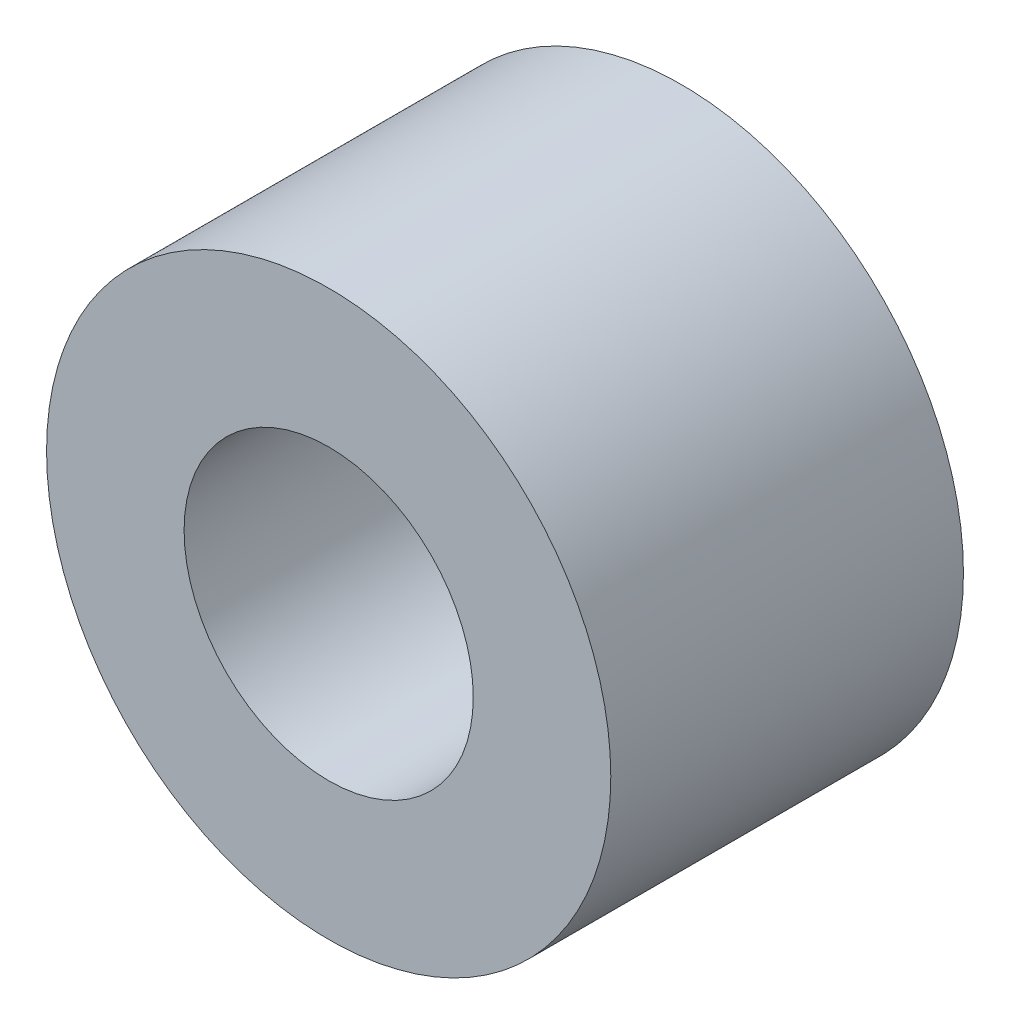
ISO-10303-21;
HEADER;
FILE_DESCRIPTION(('STEP AP214'),'2;1');
FILE_NAME('part.step','',(''),(''),'','','');
FILE_SCHEMA(('AUTOMOTIVE_DESIGN { 1 0 10303 214 1 1 1 1 }'));
ENDSEC;
DATA;
#1=APPLICATION_CONTEXT('core data for automotive mechanical design processes');
#2=APPLICATION_PROTOCOL_DEFINITION('international standard','automotive_design',2000,#1);
#3=PRODUCT_CONTEXT('',#1,'mechanical');
#4=PRODUCT('Part','Part','',(#3));
#5=PRODUCT_RELATED_PRODUCT_CATEGORY('part','',(#4));
#6=PRODUCT_DEFINITION_FORMATION('','',#4);
#7=PRODUCT_DEFINITION_CONTEXT('part definition',#1,'design');
#8=PRODUCT_DEFINITION('design','',#6,#7);
#9=PRODUCT_DEFINITION_SHAPE('','',#8);
#10=(LENGTH_UNIT() NAMED_UNIT(*) SI_UNIT(.MILLI.,.METRE.));
#11=(NAMED_UNIT(*) PLANE_ANGLE_UNIT() SI_UNIT($,.RADIAN.));
#12=(NAMED_UNIT(*) SI_UNIT($,.STERADIAN.) SOLID_ANGLE_UNIT());
#13=UNCERTAINTY_MEASURE_WITH_UNIT(LENGTH_MEASURE(1.E-05),#10,'distance_accuracy_value','');
#14=(GEOMETRIC_REPRESENTATION_CONTEXT(3) GLOBAL_UNCERTAINTY_ASSIGNED_CONTEXT((#13)) GLOBAL_UNIT_ASSIGNED_CONTEXT((#10,
#11,#12)) REPRESENTATION_CONTEXT('',''));
#15=CARTESIAN_POINT('',(0.,0.,0.));
#16=DIRECTION('',(0.,0.,1.));
#17=DIRECTION('',(1.,0.,0.));
#18=AXIS2_PLACEMENT_3D('',#15,#16,#17);
#19=CARTESIAN_POINT('',(0.,0.,10.));
#20=DIRECTION('',(0.,0.,1.));
#21=DIRECTION('',(1.,0.,0.));
#22=AXIS2_PLACEMENT_3D('',#19,#20,#21);
#23=PLANE('',#22);
#24=CARTESIAN_POINT('',(0.,0.,10.));
#25=DIRECTION('',(0.,0.,1.));
#26=DIRECTION('',(1.,0.,0.));
#27=AXIS2_PLACEMENT_3D('',#24,#25,#26);
#28=CIRCLE('',#27,8.);
#29=CARTESIAN_POINT('',(8.,0.,10.));
#30=VERTEX_POINT('',#29);
#31=EDGE_CURVE('E10',#30,#30,#28,.T.);
#32=ORIENTED_EDGE('',*,*,#31,.T.);
#33=EDGE_LOOP('',(#32));
#34=FACE_BOUND('',#33,.T.);
#35=CARTESIAN_POINT('',(0.,0.,10.));
#36=DIRECTION('',(0.,0.,1.));
#37=DIRECTION('',(1.,0.,0.));
#38=AXIS2_PLACEMENT_3D('',#35,#36,#37);
#39=CIRCLE('',#38,4.1);
#40=CARTESIAN_POINT('',(4.1,0.,10.));
#41=VERTEX_POINT('',#40);
#42=EDGE_CURVE('E52',#41,#41,#39,.T.);
#43=ORIENTED_EDGE('',*,*,#42,.F.);
#44=EDGE_LOOP('',(#43));
#45=FACE_BOUND('',#44,.T.);
#46=ADVANCED_FACE('F39',(#34,#45),#23,.T.);
#47=CARTESIAN_POINT('',(0.,0.,0.));
#48=DIRECTION('',(0.,0.,1.));
#49=DIRECTION('',(1.,0.,0.));
#50=AXIS2_PLACEMENT_3D('',#47,#48,#49);
#51=PLANE('',#50);
#52=CARTESIAN_POINT('',(0.,0.,0.));
#53=DIRECTION('',(0.,0.,1.));
#54=DIRECTION('',(1.,0.,0.));
#55=AXIS2_PLACEMENT_3D('',#52,#53,#54);
#56=CIRCLE('',#55,8.);
#57=CARTESIAN_POINT('',(8.,0.,0.));
#58=VERTEX_POINT('',#57);
#59=EDGE_CURVE('E43',#58,#58,#56,.T.);
#60=ORIENTED_EDGE('',*,*,#59,.F.);
#61=EDGE_LOOP('',(#60));
#62=FACE_BOUND('',#61,.T.);
#63=CARTESIAN_POINT('',(0.,0.,0.));
#64=DIRECTION('',(0.,0.,1.));
#65=DIRECTION('',(1.,0.,0.));
#66=AXIS2_PLACEMENT_3D('',#63,#64,#65);
#67=CIRCLE('',#66,4.1);
#68=CARTESIAN_POINT('',(4.1,0.,0.));
#69=VERTEX_POINT('',#68);
#70=EDGE_CURVE('E54',#69,#69,#67,.T.);
#71=ORIENTED_EDGE('',*,*,#70,.T.);
#72=EDGE_LOOP('',(#71));
#73=FACE_BOUND('',#72,.T.);
#74=ADVANCED_FACE('F66',(#62,#73),#51,.F.);
#75=CARTESIAN_POINT('',(0.,0.,10.));
#76=DIRECTION('',(0.,0.,-1.));
#77=DIRECTION('',(-1.,0.,0.));
#78=AXIS2_PLACEMENT_3D('',#75,#76,#77);
#79=CYLINDRICAL_SURFACE('',#78,8.);
#80=ORIENTED_EDGE('',*,*,#31,.F.);
#81=EDGE_LOOP('',(#80));
#82=FACE_BOUND('',#81,.T.);
#83=ORIENTED_EDGE('',*,*,#59,.T.);
#84=EDGE_LOOP('',(#83));
#85=FACE_BOUND('',#84,.T.);
#86=ADVANCED_FACE('F41',(#82,#85),#79,.T.);
#87=CARTESIAN_POINT('',(0.,0.,10.));
#88=DIRECTION('',(0.,0.,-1.));
#89=DIRECTION('',(-1.,0.,0.));
#90=AXIS2_PLACEMENT_3D('',#87,#88,#89);
#91=CYLINDRICAL_SURFACE('',#90,4.1);
#92=ORIENTED_EDGE('',*,*,#42,.T.);
#93=EDGE_LOOP('',(#92));
#94=FACE_BOUND('',#93,.T.);
#95=ORIENTED_EDGE('',*,*,#70,.F.);
#96=EDGE_LOOP('',(#95));
#97=FACE_BOUND('',#96,.T.);
#98=ADVANCED_FACE('F62',(#94,#97),#91,.F.);
#99=CLOSED_SHELL('',(#46,#74,#86,#98));
#100=MANIFOLD_SOLID_BREP('B2',#99);
#101=ADVANCED_BREP_SHAPE_REPRESENTATION('',(#18,#100),#14);
#102=SHAPE_DEFINITION_REPRESENTATION(#9,#101);
ENDSEC;
END-ISO-10303-21;
